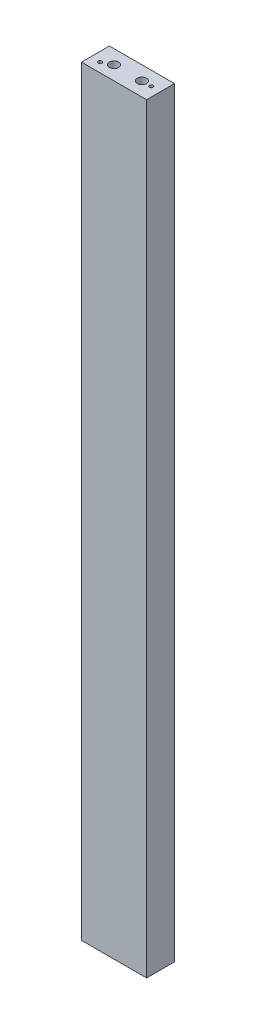
ISO-10303-21;
HEADER;
FILE_DESCRIPTION(('STEP AP214'),'2;1');
FILE_NAME('part.step','',(''),(''),'','','');
FILE_SCHEMA(('AUTOMOTIVE_DESIGN { 1 0 10303 214 1 1 1 1 }'));
ENDSEC;
DATA;
#1=APPLICATION_CONTEXT('core data for automotive mechanical design processes');
#2=APPLICATION_PROTOCOL_DEFINITION('international standard','automotive_design',2000,#1);
#3=PRODUCT_CONTEXT('',#1,'mechanical');
#4=PRODUCT('Part','Part','',(#3));
#5=PRODUCT_RELATED_PRODUCT_CATEGORY('part','',(#4));
#6=PRODUCT_DEFINITION_FORMATION('','',#4);
#7=PRODUCT_DEFINITION_CONTEXT('part definition',#1,'design');
#8=PRODUCT_DEFINITION('design','',#6,#7);
#9=PRODUCT_DEFINITION_SHAPE('','',#8);
#10=(LENGTH_UNIT() NAMED_UNIT(*) SI_UNIT(.MILLI.,.METRE.));
#11=(NAMED_UNIT(*) PLANE_ANGLE_UNIT() SI_UNIT($,.RADIAN.));
#12=(NAMED_UNIT(*) SI_UNIT($,.STERADIAN.) SOLID_ANGLE_UNIT());
#13=UNCERTAINTY_MEASURE_WITH_UNIT(LENGTH_MEASURE(1.E-05),#10,'distance_accuracy_value','');
#14=(GEOMETRIC_REPRESENTATION_CONTEXT(3) GLOBAL_UNCERTAINTY_ASSIGNED_CONTEXT((#13)) GLOBAL_UNIT_ASSIGNED_CONTEXT((#10,
#11,#12)) REPRESENTATION_CONTEXT('',''));
#15=CARTESIAN_POINT('',(0.,0.,0.));
#16=DIRECTION('',(0.,0.,1.));
#17=DIRECTION('',(1.,0.,0.));
#18=AXIS2_PLACEMENT_3D('',#15,#16,#17);
#19=CARTESIAN_POINT('',(0.,1038.225,0.));
#20=DIRECTION('',(1.,0.,0.));
#21=DIRECTION('',(0.,0.,-1.));
#22=AXIS2_PLACEMENT_3D('',#19,#20,#21);
#23=PLANE('',#22);
#24=DIRECTION('',(0.,0.,1.));
#25=VECTOR('',#24,1.);
#26=CARTESIAN_POINT('',(0.,0.,0.));
#27=LINE('',#26,#25);
#28=CARTESIAN_POINT('',(0.,0.,0.));
#29=VERTEX_POINT('',#28);
#30=CARTESIAN_POINT('',(0.,0.,38.1));
#31=VERTEX_POINT('',#30);
#32=EDGE_CURVE('E147',#29,#31,#27,.T.);
#33=ORIENTED_EDGE('',*,*,#32,.T.);
#34=DIRECTION('',(0.,-1.,0.));
#35=VECTOR('',#34,1.);
#36=CARTESIAN_POINT('',(0.,1038.225,38.1));
#37=LINE('',#36,#35);
#38=CARTESIAN_POINT('',(0.,1038.225,38.1));
#39=VERTEX_POINT('',#38);
#40=EDGE_CURVE('E11',#39,#31,#37,.T.);
#41=ORIENTED_EDGE('',*,*,#40,.F.);
#42=DIRECTION('',(0.,0.,1.));
#43=VECTOR('',#42,1.);
#44=CARTESIAN_POINT('',(0.,1038.225,0.));
#45=LINE('',#44,#43);
#46=CARTESIAN_POINT('',(0.,1038.225,0.));
#47=VERTEX_POINT('',#46);
#48=EDGE_CURVE('E156',#47,#39,#45,.T.);
#49=ORIENTED_EDGE('',*,*,#48,.F.);
#50=DIRECTION('',(0.,-1.,0.));
#51=VECTOR('',#50,1.);
#52=CARTESIAN_POINT('',(0.,1038.225,0.));
#53=LINE('',#52,#51);
#54=EDGE_CURVE('E162',#47,#29,#53,.T.);
#55=ORIENTED_EDGE('',*,*,#54,.T.);
#56=EDGE_LOOP('',(#33,#41,#49,#55));
#57=FACE_BOUND('',#56,.T.);
#58=ADVANCED_FACE('F47',(#57),#23,.F.);
#59=CARTESIAN_POINT('',(0.,1038.225,38.1));
#60=DIRECTION('',(0.,0.,-1.));
#61=DIRECTION('',(-1.,0.,0.));
#62=AXIS2_PLACEMENT_3D('',#59,#60,#61);
#63=PLANE('',#62);
#64=DIRECTION('',(1.,0.,0.));
#65=VECTOR('',#64,1.);
#66=CARTESIAN_POINT('',(0.,0.,38.1));
#67=LINE('',#66,#65);
#68=CARTESIAN_POINT('',(88.9,0.,38.1));
#69=VERTEX_POINT('',#68);
#70=EDGE_CURVE('E165',#31,#69,#67,.T.);
#71=ORIENTED_EDGE('',*,*,#70,.T.);
#72=DIRECTION('',(0.,-1.,0.));
#73=VECTOR('',#72,1.);
#74=CARTESIAN_POINT('',(88.9,1038.225,38.1));
#75=LINE('',#74,#73);
#76=CARTESIAN_POINT('',(88.9,1038.225,38.1));
#77=VERTEX_POINT('',#76);
#78=EDGE_CURVE('E55',#77,#69,#75,.T.);
#79=ORIENTED_EDGE('',*,*,#78,.F.);
#80=DIRECTION('',(1.,0.,0.));
#81=VECTOR('',#80,1.);
#82=CARTESIAN_POINT('',(0.,1038.225,38.1));
#83=LINE('',#82,#81);
#84=EDGE_CURVE('E94',#39,#77,#83,.T.);
#85=ORIENTED_EDGE('',*,*,#84,.F.);
#86=ORIENTED_EDGE('',*,*,#40,.T.);
#87=EDGE_LOOP('',(#71,#79,#85,#86));
#88=FACE_BOUND('',#87,.T.);
#89=ADVANCED_FACE('F190',(#88),#63,.F.);
#90=CARTESIAN_POINT('',(88.9,1038.225,0.));
#91=DIRECTION('',(-1.,0.,0.));
#92=DIRECTION('',(0.,0.,1.));
#93=AXIS2_PLACEMENT_3D('',#90,#91,#92);
#94=PLANE('',#93);
#95=DIRECTION('',(0.,0.,-1.));
#96=VECTOR('',#95,1.);
#97=CARTESIAN_POINT('',(88.9,0.,0.));
#98=LINE('',#97,#96);
#99=CARTESIAN_POINT('',(88.9,0.,0.));
#100=VERTEX_POINT('',#99);
#101=EDGE_CURVE('E81',#69,#100,#98,.T.);
#102=ORIENTED_EDGE('',*,*,#101,.T.);
#103=DIRECTION('',(0.,-1.,0.));
#104=VECTOR('',#103,1.);
#105=CARTESIAN_POINT('',(88.9,1038.225,0.));
#106=LINE('',#105,#104);
#107=CARTESIAN_POINT('',(88.9,1038.225,0.));
#108=VERTEX_POINT('',#107);
#109=EDGE_CURVE('E170',#108,#100,#106,.T.);
#110=ORIENTED_EDGE('',*,*,#109,.F.);
#111=DIRECTION('',(0.,0.,-1.));
#112=VECTOR('',#111,1.);
#113=CARTESIAN_POINT('',(88.9,1038.225,0.));
#114=LINE('',#113,#112);
#115=EDGE_CURVE('E159',#77,#108,#114,.T.);
#116=ORIENTED_EDGE('',*,*,#115,.F.);
#117=ORIENTED_EDGE('',*,*,#78,.T.);
#118=EDGE_LOOP('',(#102,#110,#116,#117));
#119=FACE_BOUND('',#118,.T.);
#120=ADVANCED_FACE('F172',(#119),#94,.F.);
#121=CARTESIAN_POINT('',(0.,1038.225,0.));
#122=DIRECTION('',(0.,0.,1.));
#123=DIRECTION('',(1.,0.,0.));
#124=AXIS2_PLACEMENT_3D('',#121,#122,#123);
#125=PLANE('',#124);
#126=DIRECTION('',(-1.,0.,0.));
#127=VECTOR('',#126,1.);
#128=CARTESIAN_POINT('',(0.,0.,0.));
#129=LINE('',#128,#127);
#130=EDGE_CURVE('E87',#100,#29,#129,.T.);
#131=ORIENTED_EDGE('',*,*,#130,.T.);
#132=ORIENTED_EDGE('',*,*,#54,.F.);
#133=DIRECTION('',(-1.,0.,0.));
#134=VECTOR('',#133,1.);
#135=CARTESIAN_POINT('',(0.,1038.225,0.));
#136=LINE('',#135,#134);
#137=EDGE_CURVE('E63',#108,#47,#136,.T.);
#138=ORIENTED_EDGE('',*,*,#137,.F.);
#139=ORIENTED_EDGE('',*,*,#109,.T.);
#140=EDGE_LOOP('',(#131,#132,#138,#139));
#141=FACE_BOUND('',#140,.T.);
#142=ADVANCED_FACE('F179',(#141),#125,.F.);
#143=CARTESIAN_POINT('',(0.,1038.225,0.));
#144=DIRECTION('',(0.,1.,0.));
#145=DIRECTION('',(0.,0.,1.));
#146=AXIS2_PLACEMENT_3D('',#143,#144,#145);
#147=PLANE('',#146);
#148=CARTESIAN_POINT('',(12.7,1038.225,25.4));
#149=DIRECTION('',(0.,1.,0.));
#150=DIRECTION('',(0.,0.,1.));
#151=AXIS2_PLACEMENT_3D('',#148,#149,#150);
#152=CIRCLE('',#151,2.45744999999999);
#153=CARTESIAN_POINT('',(12.7,1038.225,27.85745));
#154=VERTEX_POINT('',#153);
#155=EDGE_CURVE('E114',#154,#154,#152,.T.);
#156=ORIENTED_EDGE('',*,*,#155,.F.);
#157=EDGE_LOOP('',(#156));
#158=FACE_BOUND('',#157,.T.);
#159=CARTESIAN_POINT('',(76.2,1038.225,19.05));
#160=DIRECTION('',(0.,1.,0.));
#161=DIRECTION('',(0.,0.,1.));
#162=AXIS2_PLACEMENT_3D('',#159,#160,#161);
#163=CIRCLE('',#162,2.45744999999999);
#164=CARTESIAN_POINT('',(76.2,1038.225,21.50745));
#165=VERTEX_POINT('',#164);
#166=EDGE_CURVE('E125',#165,#165,#163,.T.);
#167=ORIENTED_EDGE('',*,*,#166,.F.);
#168=EDGE_LOOP('',(#167));
#169=FACE_BOUND('',#168,.T.);
#170=CARTESIAN_POINT('',(25.4,1038.225,19.05));
#171=DIRECTION('',(0.,1.,0.));
#172=DIRECTION('',(0.,0.,1.));
#173=AXIS2_PLACEMENT_3D('',#170,#171,#172);
#174=CIRCLE('',#173,6.35000000000001);
#175=CARTESIAN_POINT('',(25.4,1038.225,25.4));
#176=VERTEX_POINT('',#175);
#177=EDGE_CURVE('E148',#176,#176,#174,.T.);
#178=ORIENTED_EDGE('',*,*,#177,.F.);
#179=EDGE_LOOP('',(#178));
#180=FACE_BOUND('',#179,.T.);
#181=CARTESIAN_POINT('',(63.5,1038.225,19.05));
#182=DIRECTION('',(0.,1.,0.));
#183=DIRECTION('',(0.,0.,1.));
#184=AXIS2_PLACEMENT_3D('',#181,#182,#183);
#185=CIRCLE('',#184,6.35000000000001);
#186=CARTESIAN_POINT('',(63.5,1038.225,25.4));
#187=VERTEX_POINT('',#186);
#188=EDGE_CURVE('E151',#187,#187,#185,.T.);
#189=ORIENTED_EDGE('',*,*,#188,.F.);
#190=EDGE_LOOP('',(#189));
#191=FACE_BOUND('',#190,.T.);
#192=ORIENTED_EDGE('',*,*,#48,.T.);
#193=ORIENTED_EDGE('',*,*,#84,.T.);
#194=ORIENTED_EDGE('',*,*,#115,.T.);
#195=ORIENTED_EDGE('',*,*,#137,.T.);
#196=EDGE_LOOP('',(#192,#193,#194,#195));
#197=FACE_BOUND('',#196,.T.);
#198=ADVANCED_FACE('F181',(#158,#169,#180,#191,#197),#147,.T.);
#199=CARTESIAN_POINT('',(0.,0.,0.));
#200=DIRECTION('',(0.,1.,0.));
#201=DIRECTION('',(0.,0.,1.));
#202=AXIS2_PLACEMENT_3D('',#199,#200,#201);
#203=PLANE('',#202);
#204=CARTESIAN_POINT('',(44.45,0.,25.4));
#205=DIRECTION('',(0.,-1.,0.));
#206=DIRECTION('',(0.,0.,-1.));
#207=AXIS2_PLACEMENT_3D('',#204,#205,#206);
#208=CIRCLE('',#207,2.45744999999999);
#209=CARTESIAN_POINT('',(44.45,0.,22.94255));
#210=VERTEX_POINT('',#209);
#211=EDGE_CURVE('E115',#210,#210,#208,.T.);
#212=ORIENTED_EDGE('',*,*,#211,.F.);
#213=EDGE_LOOP('',(#212));
#214=FACE_BOUND('',#213,.T.);
#215=CARTESIAN_POINT('',(25.4,0.,19.05));
#216=DIRECTION('',(0.,-1.,0.));
#217=DIRECTION('',(0.,0.,-1.));
#218=AXIS2_PLACEMENT_3D('',#215,#216,#217);
#219=CIRCLE('',#218,6.35000000000001);
#220=CARTESIAN_POINT('',(25.4,0.,12.7));
#221=VERTEX_POINT('',#220);
#222=EDGE_CURVE('E136',#221,#221,#219,.T.);
#223=ORIENTED_EDGE('',*,*,#222,.F.);
#224=EDGE_LOOP('',(#223));
#225=FACE_BOUND('',#224,.T.);
#226=CARTESIAN_POINT('',(63.5,0.,19.05));
#227=DIRECTION('',(0.,-1.,0.));
#228=DIRECTION('',(0.,0.,-1.));
#229=AXIS2_PLACEMENT_3D('',#226,#227,#228);
#230=CIRCLE('',#229,6.35);
#231=CARTESIAN_POINT('',(63.5,0.,12.7));
#232=VERTEX_POINT('',#231);
#233=EDGE_CURVE('E139',#232,#232,#230,.T.);
#234=ORIENTED_EDGE('',*,*,#233,.F.);
#235=EDGE_LOOP('',(#234));
#236=FACE_BOUND('',#235,.T.);
#237=ORIENTED_EDGE('',*,*,#32,.F.);
#238=ORIENTED_EDGE('',*,*,#130,.F.);
#239=ORIENTED_EDGE('',*,*,#101,.F.);
#240=ORIENTED_EDGE('',*,*,#70,.F.);
#241=EDGE_LOOP('',(#237,#238,#239,#240));
#242=FACE_BOUND('',#241,.T.);
#243=ADVANCED_FACE('F175',(#214,#225,#236,#242),#203,.F.);
#244=CARTESIAN_POINT('',(63.5,1019.175,19.05));
#245=DIRECTION('',(0.,1.,0.));
#246=DIRECTION('',(0.,0.,1.));
#247=AXIS2_PLACEMENT_3D('',#244,#245,#246);
#248=CYLINDRICAL_SURFACE('',#247,6.35000000000001);
#249=CARTESIAN_POINT('',(63.5,1019.175,19.05));
#250=DIRECTION('',(0.,1.,0.));
#251=DIRECTION('',(0.,0.,1.));
#252=AXIS2_PLACEMENT_3D('',#249,#250,#251);
#253=CIRCLE('',#252,6.35000000000001);
#254=CARTESIAN_POINT('',(63.5,1019.175,25.4));
#255=VERTEX_POINT('',#254);
#256=EDGE_CURVE('E135',#255,#255,#253,.T.);
#257=ORIENTED_EDGE('',*,*,#256,.F.);
#258=EDGE_LOOP('',(#257));
#259=FACE_BOUND('',#258,.T.);
#260=ORIENTED_EDGE('',*,*,#188,.T.);
#261=EDGE_LOOP('',(#260));
#262=FACE_BOUND('',#261,.T.);
#263=ADVANCED_FACE('F225',(#259,#262),#248,.F.);
#264=CARTESIAN_POINT('',(63.5,1019.175,19.05));
#265=DIRECTION('',(0.,1.,0.));
#266=DIRECTION('',(0.,0.,1.));
#267=AXIS2_PLACEMENT_3D('',#264,#265,#266);
#268=PLANE('',#267);
#269=ORIENTED_EDGE('',*,*,#256,.T.);
#270=EDGE_LOOP('',(#269));
#271=FACE_BOUND('',#270,.T.);
#272=ADVANCED_FACE('F234',(#271),#268,.T.);
#273=CARTESIAN_POINT('',(25.4,1019.175,19.05));
#274=DIRECTION('',(0.,1.,0.));
#275=DIRECTION('',(0.,0.,1.));
#276=AXIS2_PLACEMENT_3D('',#273,#274,#275);
#277=CYLINDRICAL_SURFACE('',#276,6.35000000000001);
#278=CARTESIAN_POINT('',(25.4,1019.175,19.05));
#279=DIRECTION('',(0.,1.,0.));
#280=DIRECTION('',(0.,0.,1.));
#281=AXIS2_PLACEMENT_3D('',#278,#279,#280);
#282=CIRCLE('',#281,6.35000000000001);
#283=CARTESIAN_POINT('',(25.4,1019.175,25.4));
#284=VERTEX_POINT('',#283);
#285=EDGE_CURVE('E144',#284,#284,#282,.T.);
#286=ORIENTED_EDGE('',*,*,#285,.F.);
#287=EDGE_LOOP('',(#286));
#288=FACE_BOUND('',#287,.T.);
#289=ORIENTED_EDGE('',*,*,#177,.T.);
#290=EDGE_LOOP('',(#289));
#291=FACE_BOUND('',#290,.T.);
#292=ADVANCED_FACE('F244',(#288,#291),#277,.F.);
#293=CARTESIAN_POINT('',(25.4,1019.175,19.05));
#294=DIRECTION('',(0.,1.,0.));
#295=DIRECTION('',(0.,0.,1.));
#296=AXIS2_PLACEMENT_3D('',#293,#294,#295);
#297=PLANE('',#296);
#298=ORIENTED_EDGE('',*,*,#285,.T.);
#299=EDGE_LOOP('',(#298));
#300=FACE_BOUND('',#299,.T.);
#301=ADVANCED_FACE('F254',(#300),#297,.T.);
#302=CARTESIAN_POINT('',(63.5,19.05,19.05));
#303=DIRECTION('',(0.,-1.,0.));
#304=DIRECTION('',(0.,0.,-1.));
#305=AXIS2_PLACEMENT_3D('',#302,#303,#304);
#306=CYLINDRICAL_SURFACE('',#305,6.35);
#307=CARTESIAN_POINT('',(63.5,19.05,19.05));
#308=DIRECTION('',(0.,-1.,0.));
#309=DIRECTION('',(0.,0.,-1.));
#310=AXIS2_PLACEMENT_3D('',#307,#308,#309);
#311=CIRCLE('',#310,6.35);
#312=CARTESIAN_POINT('',(63.5,19.05,12.7));
#313=VERTEX_POINT('',#312);
#314=EDGE_CURVE('E131',#313,#313,#311,.T.);
#315=ORIENTED_EDGE('',*,*,#314,.F.);
#316=EDGE_LOOP('',(#315));
#317=FACE_BOUND('',#316,.T.);
#318=ORIENTED_EDGE('',*,*,#233,.T.);
#319=EDGE_LOOP('',(#318));
#320=FACE_BOUND('',#319,.T.);
#321=ADVANCED_FACE('F264',(#317,#320),#306,.F.);
#322=CARTESIAN_POINT('',(63.5,19.05,19.05));
#323=DIRECTION('',(0.,-1.,0.));
#324=DIRECTION('',(0.,0.,-1.));
#325=AXIS2_PLACEMENT_3D('',#322,#323,#324);
#326=PLANE('',#325);
#327=ORIENTED_EDGE('',*,*,#314,.T.);
#328=EDGE_LOOP('',(#327));
#329=FACE_BOUND('',#328,.T.);
#330=ADVANCED_FACE('F274',(#329),#326,.T.);
#331=CARTESIAN_POINT('',(25.4,19.05,19.05));
#332=DIRECTION('',(0.,-1.,0.));
#333=DIRECTION('',(0.,0.,-1.));
#334=AXIS2_PLACEMENT_3D('',#331,#332,#333);
#335=CYLINDRICAL_SURFACE('',#334,6.35000000000001);
#336=CARTESIAN_POINT('',(25.4,19.05,19.05));
#337=DIRECTION('',(0.,-1.,0.));
#338=DIRECTION('',(0.,0.,-1.));
#339=AXIS2_PLACEMENT_3D('',#336,#337,#338);
#340=CIRCLE('',#339,6.35000000000001);
#341=CARTESIAN_POINT('',(25.4,19.05,12.7));
#342=VERTEX_POINT('',#341);
#343=EDGE_CURVE('E132',#342,#342,#340,.T.);
#344=ORIENTED_EDGE('',*,*,#343,.F.);
#345=EDGE_LOOP('',(#344));
#346=FACE_BOUND('',#345,.T.);
#347=ORIENTED_EDGE('',*,*,#222,.T.);
#348=EDGE_LOOP('',(#347));
#349=FACE_BOUND('',#348,.T.);
#350=ADVANCED_FACE('F284',(#346,#349),#335,.F.);
#351=CARTESIAN_POINT('',(25.4,19.05,19.05));
#352=DIRECTION('',(0.,-1.,0.));
#353=DIRECTION('',(0.,0.,-1.));
#354=AXIS2_PLACEMENT_3D('',#351,#352,#353);
#355=PLANE('',#354);
#356=ORIENTED_EDGE('',*,*,#343,.T.);
#357=EDGE_LOOP('',(#356));
#358=FACE_BOUND('',#357,.T.);
#359=ADVANCED_FACE('F294',(#358),#355,.T.);
#360=CARTESIAN_POINT('',(76.2,962.025,19.05));
#361=DIRECTION('',(0.,1.,0.));
#362=DIRECTION('',(0.,0.,1.));
#363=AXIS2_PLACEMENT_3D('',#360,#361,#362);
#364=CONICAL_SURFACE('',#363,2.45744999999997,1.02974425867666);
#365=CARTESIAN_POINT('',(76.2,960.548415071771,19.05));
#366=VERTEX_POINT('',#365);
#367=VERTEX_LOOP('',#366);
#368=FACE_BOUND('',#367,.T.);
#369=CARTESIAN_POINT('',(76.2,962.025,19.05));
#370=DIRECTION('',(0.,1.,0.));
#371=DIRECTION('',(0.,0.,1.));
#372=AXIS2_PLACEMENT_3D('',#369,#370,#371);
#373=CIRCLE('',#372,2.45744999999997);
#374=CARTESIAN_POINT('',(76.2,962.025,21.50745));
#375=VERTEX_POINT('',#374);
#376=EDGE_CURVE('E128',#375,#375,#373,.T.);
#377=ORIENTED_EDGE('',*,*,#376,.T.);
#378=EDGE_LOOP('',(#377));
#379=FACE_BOUND('',#378,.T.);
#380=ADVANCED_FACE('F303',(#368,#379),#364,.F.);
#381=CARTESIAN_POINT('',(76.2,1038.225,19.05));
#382=DIRECTION('',(0.,1.,0.));
#383=DIRECTION('',(0.,0.,1.));
#384=AXIS2_PLACEMENT_3D('',#381,#382,#383);
#385=CYLINDRICAL_SURFACE('',#384,2.45744999999998);
#386=ORIENTED_EDGE('',*,*,#376,.F.);
#387=EDGE_LOOP('',(#386));
#388=FACE_BOUND('',#387,.T.);
#389=ORIENTED_EDGE('',*,*,#166,.T.);
#390=EDGE_LOOP('',(#389));
#391=FACE_BOUND('',#390,.T.);
#392=ADVANCED_FACE('F312',(#388,#391),#385,.F.);
#393=CARTESIAN_POINT('',(12.7,962.025,25.4));
#394=DIRECTION('',(0.,1.,0.));
#395=DIRECTION('',(0.,0.,1.));
#396=AXIS2_PLACEMENT_3D('',#393,#394,#395);
#397=CONICAL_SURFACE('',#396,2.45744999999998,1.02974425867667);
#398=CARTESIAN_POINT('',(12.7,960.548415071771,25.4));
#399=VERTEX_POINT('',#398);
#400=VERTEX_LOOP('',#399);
#401=FACE_BOUND('',#400,.T.);
#402=CARTESIAN_POINT('',(12.7,962.025,25.4));
#403=DIRECTION('',(0.,1.,0.));
#404=DIRECTION('',(0.,0.,1.));
#405=AXIS2_PLACEMENT_3D('',#402,#403,#404);
#406=CIRCLE('',#405,2.45744999999998);
#407=CARTESIAN_POINT('',(12.7,962.025,27.85745));
#408=VERTEX_POINT('',#407);
#409=EDGE_CURVE('E118',#408,#408,#406,.T.);
#410=ORIENTED_EDGE('',*,*,#409,.T.);
#411=EDGE_LOOP('',(#410));
#412=FACE_BOUND('',#411,.T.);
#413=ADVANCED_FACE('F322',(#401,#412),#397,.F.);
#414=CARTESIAN_POINT('',(12.7,1038.225,25.4));
#415=DIRECTION('',(0.,1.,0.));
#416=DIRECTION('',(0.,0.,1.));
#417=AXIS2_PLACEMENT_3D('',#414,#415,#416);
#418=CYLINDRICAL_SURFACE('',#417,2.45744999999998);
#419=ORIENTED_EDGE('',*,*,#409,.F.);
#420=EDGE_LOOP('',(#419));
#421=FACE_BOUND('',#420,.T.);
#422=ORIENTED_EDGE('',*,*,#155,.T.);
#423=EDGE_LOOP('',(#422));
#424=FACE_BOUND('',#423,.T.);
#425=ADVANCED_FACE('F108',(#421,#424),#418,.F.);
#426=CARTESIAN_POINT('',(44.45,76.2,25.4));
#427=DIRECTION('',(0.,-1.,0.));
#428=DIRECTION('',(0.,0.,-1.));
#429=AXIS2_PLACEMENT_3D('',#426,#427,#428);
#430=CONICAL_SURFACE('',#429,2.45744999999998,1.02974425867664);
#431=CARTESIAN_POINT('',(44.45,77.6765849282293,25.4));
#432=VERTEX_POINT('',#431);
#433=VERTEX_LOOP('',#432);
#434=FACE_BOUND('',#433,.T.);
#435=CARTESIAN_POINT('',(44.45,76.2,25.4));
#436=DIRECTION('',(0.,-1.,0.));
#437=DIRECTION('',(0.,0.,-1.));
#438=AXIS2_PLACEMENT_3D('',#435,#436,#437);
#439=CIRCLE('',#438,2.45744999999998);
#440=CARTESIAN_POINT('',(44.45,76.2,22.94255));
#441=VERTEX_POINT('',#440);
#442=EDGE_CURVE('E112',#441,#441,#439,.T.);
#443=ORIENTED_EDGE('',*,*,#442,.T.);
#444=EDGE_LOOP('',(#443));
#445=FACE_BOUND('',#444,.T.);
#446=ADVANCED_FACE('F104',(#434,#445),#430,.F.);
#447=CARTESIAN_POINT('',(44.45,0.,25.4));
#448=DIRECTION('',(0.,-1.,0.));
#449=DIRECTION('',(0.,0.,-1.));
#450=AXIS2_PLACEMENT_3D('',#447,#448,#449);
#451=CYLINDRICAL_SURFACE('',#450,2.45744999999999);
#452=ORIENTED_EDGE('',*,*,#442,.F.);
#453=EDGE_LOOP('',(#452));
#454=FACE_BOUND('',#453,.T.);
#455=ORIENTED_EDGE('',*,*,#211,.T.);
#456=EDGE_LOOP('',(#455));
#457=FACE_BOUND('',#456,.T.);
#458=ADVANCED_FACE('F107',(#454,#457),#451,.F.);
#459=CLOSED_SHELL('',(#58,#89,#120,#142,#198,#243,#263,#272,#292,#301,#321,#330,#350,#359,#380,
#392,#413,#425,#446,#458));
#460=MANIFOLD_SOLID_BREP('B2',#459);
#461=ADVANCED_BREP_SHAPE_REPRESENTATION('',(#18,#460),#14);
#462=SHAPE_DEFINITION_REPRESENTATION(#9,#461);
ENDSEC;
END-ISO-10303-21;
